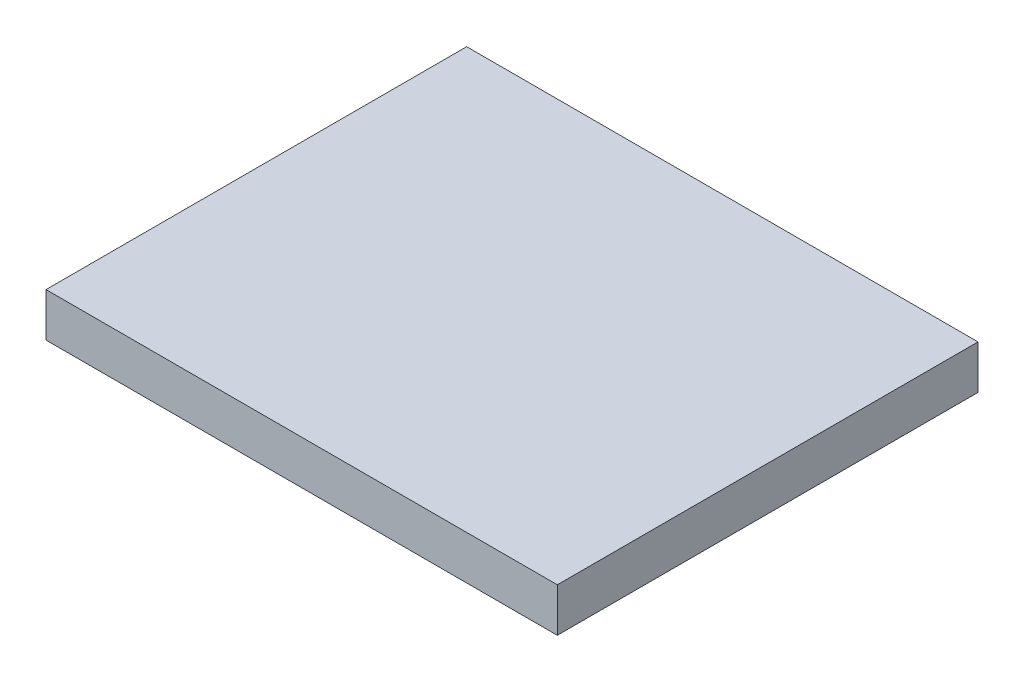
ISO-10303-21;
HEADER;
FILE_DESCRIPTION(('STEP AP214'),'2;1');
FILE_NAME('part.step','',(''),(''),'','','');
FILE_SCHEMA(('AUTOMOTIVE_DESIGN { 1 0 10303 214 1 1 1 1 }'));
ENDSEC;
DATA;
#1=APPLICATION_CONTEXT('core data for automotive mechanical design processes');
#2=APPLICATION_PROTOCOL_DEFINITION('international standard','automotive_design',2000,#1);
#3=PRODUCT_CONTEXT('',#1,'mechanical');
#4=PRODUCT('Part','Part','',(#3));
#5=PRODUCT_RELATED_PRODUCT_CATEGORY('part','',(#4));
#6=PRODUCT_DEFINITION_FORMATION('','',#4);
#7=PRODUCT_DEFINITION_CONTEXT('part definition',#1,'design');
#8=PRODUCT_DEFINITION('design','',#6,#7);
#9=PRODUCT_DEFINITION_SHAPE('','',#8);
#10=(LENGTH_UNIT() NAMED_UNIT(*) SI_UNIT(.MILLI.,.METRE.));
#11=(NAMED_UNIT(*) PLANE_ANGLE_UNIT() SI_UNIT($,.RADIAN.));
#12=(NAMED_UNIT(*) SI_UNIT($,.STERADIAN.) SOLID_ANGLE_UNIT());
#13=UNCERTAINTY_MEASURE_WITH_UNIT(LENGTH_MEASURE(1.E-05),#10,'distance_accuracy_value','');
#14=(GEOMETRIC_REPRESENTATION_CONTEXT(3) GLOBAL_UNCERTAINTY_ASSIGNED_CONTEXT((#13)) GLOBAL_UNIT_ASSIGNED_CONTEXT((#10,
#11,#12)) REPRESENTATION_CONTEXT('',''));
#15=CARTESIAN_POINT('',(0.,0.,0.));
#16=DIRECTION('',(0.,0.,1.));
#17=DIRECTION('',(1.,0.,0.));
#18=AXIS2_PLACEMENT_3D('',#15,#16,#17);
#19=CARTESIAN_POINT('',(-51.190756185747,10.,-26.8025802769216));
#20=DIRECTION('',(1.,0.,0.));
#21=DIRECTION('',(0.,0.,-1.));
#22=AXIS2_PLACEMENT_3D('',#19,#20,#21);
#23=PLANE('',#22);
#24=DIRECTION('',(0.,0.,1.));
#25=VECTOR('',#24,1.);
#26=CARTESIAN_POINT('',(-51.190756185747,0.,-26.8025802769216));
#27=LINE('',#26,#25);
#28=CARTESIAN_POINT('',(-51.190756185747,0.,-26.8025802769216));
#29=VERTEX_POINT('',#28);
#30=CARTESIAN_POINT('',(-51.190756185747,0.,69.3174623718846));
#31=VERTEX_POINT('',#30);
#32=EDGE_CURVE('E96',#29,#31,#27,.T.);
#33=ORIENTED_EDGE('',*,*,#32,.T.);
#34=DIRECTION('',(0.,-1.,0.));
#35=VECTOR('',#34,1.);
#36=CARTESIAN_POINT('',(-51.190756185747,10.,69.3174623718846));
#37=LINE('',#36,#35);
#38=CARTESIAN_POINT('',(-51.190756185747,10.,69.3174623718846));
#39=VERTEX_POINT('',#38);
#40=EDGE_CURVE('E11',#39,#31,#37,.T.);
#41=ORIENTED_EDGE('',*,*,#40,.F.);
#42=DIRECTION('',(0.,0.,1.));
#43=VECTOR('',#42,1.);
#44=CARTESIAN_POINT('',(-51.190756185747,10.,-26.8025802769216));
#45=LINE('',#44,#43);
#46=CARTESIAN_POINT('',(-51.190756185747,10.,-26.8025802769216));
#47=VERTEX_POINT('',#46);
#48=EDGE_CURVE('E84',#47,#39,#45,.T.);
#49=ORIENTED_EDGE('',*,*,#48,.F.);
#50=DIRECTION('',(0.,-1.,0.));
#51=VECTOR('',#50,1.);
#52=CARTESIAN_POINT('',(-51.190756185747,10.,-26.8025802769216));
#53=LINE('',#52,#51);
#54=EDGE_CURVE('E92',#47,#29,#53,.T.);
#55=ORIENTED_EDGE('',*,*,#54,.T.);
#56=EDGE_LOOP('',(#33,#41,#49,#55));
#57=FACE_BOUND('',#56,.T.);
#58=ADVANCED_FACE('F33',(#57),#23,.F.);
#59=CARTESIAN_POINT('',(-51.190756185747,10.,69.3174623718846));
#60=DIRECTION('',(0.,0.,-1.));
#61=DIRECTION('',(-1.,0.,0.));
#62=AXIS2_PLACEMENT_3D('',#59,#60,#61);
#63=PLANE('',#62);
#64=DIRECTION('',(1.,0.,0.));
#65=VECTOR('',#64,1.);
#66=CARTESIAN_POINT('',(-51.190756185747,0.,69.3174623718846));
#67=LINE('',#66,#65);
#68=CARTESIAN_POINT('',(65.6378690911197,0.,69.3174623718846));
#69=VERTEX_POINT('',#68);
#70=EDGE_CURVE('E88',#31,#69,#67,.T.);
#71=ORIENTED_EDGE('',*,*,#70,.T.);
#72=DIRECTION('',(0.,-1.,0.));
#73=VECTOR('',#72,1.);
#74=CARTESIAN_POINT('',(65.6378690911197,10.,69.3174623718846));
#75=LINE('',#74,#73);
#76=CARTESIAN_POINT('',(65.6378690911197,10.,69.3174623718846));
#77=VERTEX_POINT('',#76);
#78=EDGE_CURVE('E41',#77,#69,#75,.T.);
#79=ORIENTED_EDGE('',*,*,#78,.F.);
#80=DIRECTION('',(1.,0.,0.));
#81=VECTOR('',#80,1.);
#82=CARTESIAN_POINT('',(-51.190756185747,10.,69.3174623718846));
#83=LINE('',#82,#81);
#84=EDGE_CURVE('E79',#39,#77,#83,.T.);
#85=ORIENTED_EDGE('',*,*,#84,.F.);
#86=ORIENTED_EDGE('',*,*,#40,.T.);
#87=EDGE_LOOP('',(#71,#79,#85,#86));
#88=FACE_BOUND('',#87,.T.);
#89=ADVANCED_FACE('F87',(#88),#63,.F.);
#90=CARTESIAN_POINT('',(65.6378690911197,10.,-26.8025802769216));
#91=DIRECTION('',(-1.,0.,0.));
#92=DIRECTION('',(0.,0.,1.));
#93=AXIS2_PLACEMENT_3D('',#90,#91,#92);
#94=PLANE('',#93);
#95=DIRECTION('',(0.,0.,-1.));
#96=VECTOR('',#95,1.);
#97=CARTESIAN_POINT('',(65.6378690911197,0.,-26.8025802769216));
#98=LINE('',#97,#96);
#99=CARTESIAN_POINT('',(65.6378690911197,0.,-26.8025802769216));
#100=VERTEX_POINT('',#99);
#101=EDGE_CURVE('E66',#69,#100,#98,.T.);
#102=ORIENTED_EDGE('',*,*,#101,.T.);
#103=DIRECTION('',(0.,-1.,0.));
#104=VECTOR('',#103,1.);
#105=CARTESIAN_POINT('',(65.6378690911197,10.,-26.8025802769216));
#106=LINE('',#105,#104);
#107=CARTESIAN_POINT('',(65.6378690911197,10.,-26.8025802769216));
#108=VERTEX_POINT('',#107);
#109=EDGE_CURVE('E89',#108,#100,#106,.T.);
#110=ORIENTED_EDGE('',*,*,#109,.F.);
#111=DIRECTION('',(0.,0.,-1.));
#112=VECTOR('',#111,1.);
#113=CARTESIAN_POINT('',(65.6378690911197,10.,-26.8025802769216));
#114=LINE('',#113,#112);
#115=EDGE_CURVE('E82',#77,#108,#114,.T.);
#116=ORIENTED_EDGE('',*,*,#115,.F.);
#117=ORIENTED_EDGE('',*,*,#78,.T.);
#118=EDGE_LOOP('',(#102,#110,#116,#117));
#119=FACE_BOUND('',#118,.T.);
#120=ADVANCED_FACE('F90',(#119),#94,.F.);
#121=CARTESIAN_POINT('',(-51.190756185747,10.,-26.8025802769216));
#122=DIRECTION('',(0.,0.,1.));
#123=DIRECTION('',(1.,0.,0.));
#124=AXIS2_PLACEMENT_3D('',#121,#122,#123);
#125=PLANE('',#124);
#126=DIRECTION('',(-1.,0.,0.));
#127=VECTOR('',#126,1.);
#128=CARTESIAN_POINT('',(-51.190756185747,0.,-26.8025802769216));
#129=LINE('',#128,#127);
#130=EDGE_CURVE('E72',#100,#29,#129,.T.);
#131=ORIENTED_EDGE('',*,*,#130,.T.);
#132=ORIENTED_EDGE('',*,*,#54,.F.);
#133=DIRECTION('',(-1.,0.,0.));
#134=VECTOR('',#133,1.);
#135=CARTESIAN_POINT('',(-51.190756185747,10.,-26.8025802769216));
#136=LINE('',#135,#134);
#137=EDGE_CURVE('E49',#108,#47,#136,.T.);
#138=ORIENTED_EDGE('',*,*,#137,.F.);
#139=ORIENTED_EDGE('',*,*,#109,.T.);
#140=EDGE_LOOP('',(#131,#132,#138,#139));
#141=FACE_BOUND('',#140,.T.);
#142=ADVANCED_FACE('F103',(#141),#125,.F.);
#143=CARTESIAN_POINT('',(0.,10.,0.));
#144=DIRECTION('',(0.,1.,0.));
#145=DIRECTION('',(0.,0.,1.));
#146=AXIS2_PLACEMENT_3D('',#143,#144,#145);
#147=PLANE('',#146);
#148=ORIENTED_EDGE('',*,*,#48,.T.);
#149=ORIENTED_EDGE('',*,*,#84,.T.);
#150=ORIENTED_EDGE('',*,*,#115,.T.);
#151=ORIENTED_EDGE('',*,*,#137,.T.);
#152=EDGE_LOOP('',(#148,#149,#150,#151));
#153=FACE_BOUND('',#152,.T.);
#154=ADVANCED_FACE('F80',(#153),#147,.T.);
#155=CARTESIAN_POINT('',(0.,0.,0.));
#156=DIRECTION('',(0.,1.,0.));
#157=DIRECTION('',(0.,0.,1.));
#158=AXIS2_PLACEMENT_3D('',#155,#156,#157);
#159=PLANE('',#158);
#160=ORIENTED_EDGE('',*,*,#32,.F.);
#161=ORIENTED_EDGE('',*,*,#130,.F.);
#162=ORIENTED_EDGE('',*,*,#101,.F.);
#163=ORIENTED_EDGE('',*,*,#70,.F.);
#164=EDGE_LOOP('',(#160,#161,#162,#163));
#165=FACE_BOUND('',#164,.T.);
#166=ADVANCED_FACE('F106',(#165),#159,.F.);
#167=CLOSED_SHELL('',(#58,#89,#120,#142,#154,#166));
#168=MANIFOLD_SOLID_BREP('B2',#167);
#169=ADVANCED_BREP_SHAPE_REPRESENTATION('',(#18,#168),#14);
#170=SHAPE_DEFINITION_REPRESENTATION(#9,#169);
ENDSEC;
END-ISO-10303-21;
